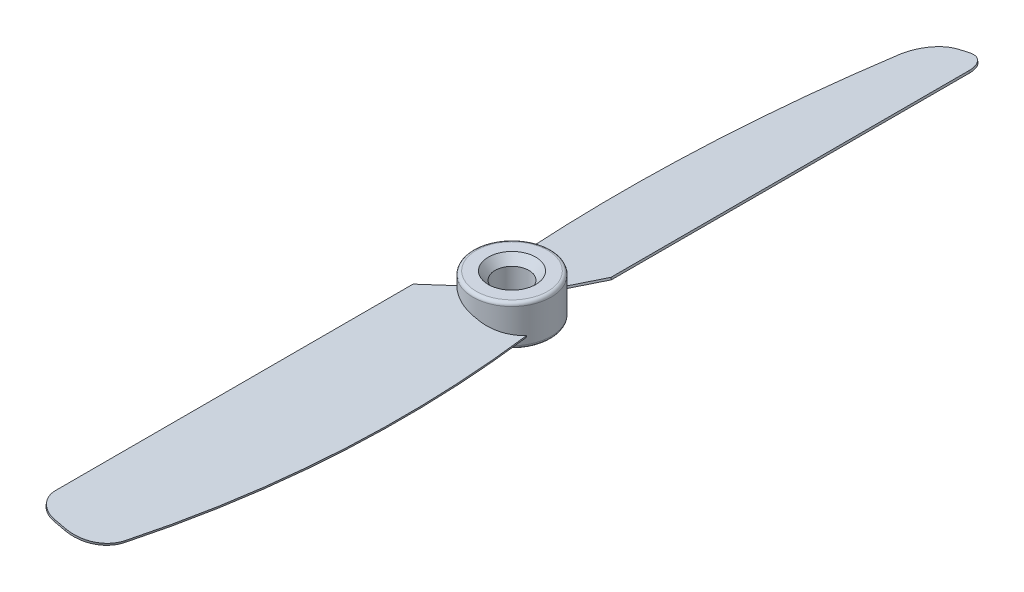
ISO-10303-21;
HEADER;
FILE_DESCRIPTION(('STEP AP214'),'2;1');
FILE_NAME('part.step','',(''),(''),'','','');
FILE_SCHEMA(('AUTOMOTIVE_DESIGN { 1 0 10303 214 1 1 1 1 }'));
ENDSEC;
DATA;
#1=APPLICATION_CONTEXT('core data for automotive mechanical design processes');
#2=APPLICATION_PROTOCOL_DEFINITION('international standard','automotive_design',2000,#1);
#3=PRODUCT_CONTEXT('',#1,'mechanical');
#4=PRODUCT('Part','Part','',(#3));
#5=PRODUCT_RELATED_PRODUCT_CATEGORY('part','',(#4));
#6=PRODUCT_DEFINITION_FORMATION('','',#4);
#7=PRODUCT_DEFINITION_CONTEXT('part definition',#1,'design');
#8=PRODUCT_DEFINITION('design','',#6,#7);
#9=PRODUCT_DEFINITION_SHAPE('','',#8);
#10=(LENGTH_UNIT() NAMED_UNIT(*) SI_UNIT(.MILLI.,.METRE.));
#11=(NAMED_UNIT(*) PLANE_ANGLE_UNIT() SI_UNIT($,.RADIAN.));
#12=(NAMED_UNIT(*) SI_UNIT($,.STERADIAN.) SOLID_ANGLE_UNIT());
#13=UNCERTAINTY_MEASURE_WITH_UNIT(LENGTH_MEASURE(1.E-05),#10,'distance_accuracy_value','');
#14=(GEOMETRIC_REPRESENTATION_CONTEXT(3) GLOBAL_UNCERTAINTY_ASSIGNED_CONTEXT((#13)) GLOBAL_UNIT_ASSIGNED_CONTEXT((#10,
#11,#12)) REPRESENTATION_CONTEXT('',''));
#15=CARTESIAN_POINT('',(0.,0.,0.));
#16=DIRECTION('',(0.,0.,1.));
#17=DIRECTION('',(1.,0.,0.));
#18=AXIS2_PLACEMENT_3D('',#15,#16,#17);
#19=CARTESIAN_POINT('',(0.,3.,0.));
#20=DIRECTION('',(0.,-1.,0.));
#21=DIRECTION('',(0.,0.,-1.));
#22=AXIS2_PLACEMENT_3D('',#19,#20,#21);
#23=CYLINDRICAL_SURFACE('',#22,5.75);
#24=CARTESIAN_POINT('',(0.,-2.5,0.));
#25=DIRECTION('',(0.,1.,0.));
#26=DIRECTION('',(0.,0.,1.));
#27=AXIS2_PLACEMENT_3D('',#24,#25,#26);
#28=CIRCLE('',#27,5.75);
#29=CARTESIAN_POINT('',(0.,-2.5,5.75));
#30=VERTEX_POINT('',#29);
#31=EDGE_CURVE('E411',#30,#30,#28,.T.);
#32=ORIENTED_EDGE('',*,*,#31,.T.);
#33=EDGE_LOOP('',(#32));
#34=FACE_BOUND('',#33,.T.);
#35=CARTESIAN_POINT('',(0.,2.5,0.));
#36=DIRECTION('',(0.,1.,0.));
#37=DIRECTION('',(0.,0.,1.));
#38=AXIS2_PLACEMENT_3D('',#35,#36,#37);
#39=CIRCLE('',#38,5.75);
#40=CARTESIAN_POINT('',(0.,2.5,5.75));
#41=VERTEX_POINT('',#40);
#42=EDGE_CURVE('E409',#41,#41,#39,.F.);
#43=ORIENTED_EDGE('',*,*,#42,.T.);
#44=EDGE_LOOP('',(#43));
#45=FACE_BOUND('',#44,.T.);
#46=CARTESIAN_POINT('',(0.,-0.153945616169009,0.));
#47=DIRECTION('',(0.224951054343865,0.974370064785235,0.));
#48=DIRECTION('',(0.974370064785235,-0.224951054343865,0.));
#49=AXIS2_PLACEMENT_3D('',#46,#47,#48);
#50=ELLIPSE('',#49,5.901248619812,5.75);
#51=CARTESIAN_POINT('',(-4.11748225008239,0.796650062899129,4.0135819314244));
#52=VERTEX_POINT('',#51);
#53=CARTESIAN_POINT('',(0.320003598355955,-0.22782426807512,5.74108854635071));
#54=VERTEX_POINT('',#53);
#55=EDGE_CURVE('E408',#52,#54,#50,.T.);
#56=ORIENTED_EDGE('',*,*,#55,.F.);
#57=CARTESIAN_POINT('',(0.,4.77330898299904,0.));
#58=DIRECTION('',(0.769518397839671,-0.177657320547087,0.613416100084025));
#59=DIRECTION('',(-0.13892046613427,-0.984092412558917,-0.110739458338062));
#60=AXIS2_PLACEMENT_3D('',#57,#58,#59);
#61=ELLIPSE('',#60,32.3656800760766,5.75);
#62=CARTESIAN_POINT('',(-4.07933525218879,1.09573436683658,4.05234794905988));
#63=VERTEX_POINT('',#62);
#64=EDGE_CURVE('E314',#63,#52,#61,.T.);
#65=ORIENTED_EDGE('',*,*,#64,.F.);
#66=CARTESIAN_POINT('',(0.,0.153945616169007,0.));
#67=DIRECTION('',(0.224951054343865,0.974370064785235,0.));
#68=DIRECTION('',(0.974370064785235,-0.224951054343865,0.));
#69=AXIS2_PLACEMENT_3D('',#66,#67,#68);
#70=ELLIPSE('',#69,5.901248619812,5.75);
#71=CARTESIAN_POINT('',(0.354622157583411,0.0720746401146822,5.73905420129059));
#72=VERTEX_POINT('',#71);
#73=EDGE_CURVE('E315',#63,#72,#70,.T.);
#74=ORIENTED_EDGE('',*,*,#73,.T.);
#75=CARTESIAN_POINT('',(0.32000359835526,-0.227824268074959,5.74108854635068));
#76=CARTESIAN_POINT('',(0.325773371717221,-0.177840999841669,5.74076694689686));
#77=CARTESIAN_POINT('',(0.331543138333848,-0.12785779004254,5.74043661841495));
#78=CARTESIAN_POINT('',(0.343082658076433,-0.0278914873126082,5.73975850339492));
#79=CARTESIAN_POINT('',(0.348852411202391,0.0220916056181957,5.7394107168568));
#80=CARTESIAN_POINT('',(0.354622157583015,0.0720746401148375,5.73905420129059));
#81=B_SPLINE_CURVE_WITH_KNOTS('',3,(#75,#76,#77,#78,#79,#80),.UNSPECIFIED.,.F.,.F.,(4,2,4),(0.,
0.150948617979297,0.301897235958594),.UNSPECIFIED.);
#82=EDGE_CURVE('E306',#54,#72,#81,.T.);
#83=ORIENTED_EDGE('',*,*,#82,.F.);
#84=EDGE_LOOP('',(#56,#65,#74,#83));
#85=FACE_BOUND('',#84,.T.);
#86=CARTESIAN_POINT('',(-0.32000359835526,-0.227824268074959,-5.74108854635068));
#87=CARTESIAN_POINT('',(-0.325773371717221,-0.177840999841669,-5.74076694689686));
#88=CARTESIAN_POINT('',(-0.331543138333848,-0.12785779004254,-5.74043661841495));
#89=CARTESIAN_POINT('',(-0.343082658076433,-0.0278914873126082,-5.73975850339492));
#90=CARTESIAN_POINT('',(-0.348852411202391,0.0220916056181957,-5.7394107168568));
#91=CARTESIAN_POINT('',(-0.354622157583015,0.0720746401148375,-5.73905420129059));
#92=B_SPLINE_CURVE_WITH_KNOTS('',3,(#86,#87,#88,#89,#90,#91),.UNSPECIFIED.,.F.,.F.,(4,2,4),(0.,
0.150948617979297,0.301897235958594),.UNSPECIFIED.);
#93=CARTESIAN_POINT('',(-0.320003598355955,-0.22782426807512,-5.74108854635071));
#94=VERTEX_POINT('',#93);
#95=CARTESIAN_POINT('',(-0.35462215758341,0.0720746401146809,-5.73905420129057));
#96=VERTEX_POINT('',#95);
#97=EDGE_CURVE('E61',#94,#96,#92,.T.);
#98=ORIENTED_EDGE('',*,*,#97,.F.);
#99=CARTESIAN_POINT('',(0.,-0.153945616169009,0.));
#100=DIRECTION('',(-0.224951054343865,0.974370064785235,0.));
#101=DIRECTION('',(-0.974370064785235,-0.224951054343865,0.));
#102=AXIS2_PLACEMENT_3D('',#99,#100,#101);
#103=ELLIPSE('',#102,5.901248619812,5.75);
#104=CARTESIAN_POINT('',(4.11748225008239,0.796650062899129,-4.0135819314244));
#105=VERTEX_POINT('',#104);
#106=EDGE_CURVE('E179',#105,#94,#103,.T.);
#107=ORIENTED_EDGE('',*,*,#106,.F.);
#108=CARTESIAN_POINT('',(0.,4.77330898299904,0.));
#109=DIRECTION('',(-0.769518397839671,-0.177657320547087,-0.613416100084025));
#110=DIRECTION('',(0.13892046613427,-0.984092412558917,0.110739458338062));
#111=AXIS2_PLACEMENT_3D('',#108,#109,#110);
#112=ELLIPSE('',#111,32.3656800760766,5.75);
#113=CARTESIAN_POINT('',(4.07933525218879,1.09573436683658,-4.05234794905988));
#114=VERTEX_POINT('',#113);
#115=EDGE_CURVE('E172',#114,#105,#112,.T.);
#116=ORIENTED_EDGE('',*,*,#115,.F.);
#117=CARTESIAN_POINT('',(0.,0.153945616169007,0.));
#118=DIRECTION('',(-0.224951054343865,0.974370064785235,0.));
#119=DIRECTION('',(-0.974370064785235,-0.224951054343865,0.));
#120=AXIS2_PLACEMENT_3D('',#117,#118,#119);
#121=ELLIPSE('',#120,5.901248619812,5.75);
#122=EDGE_CURVE('E160',#114,#96,#121,.T.);
#123=ORIENTED_EDGE('',*,*,#122,.T.);
#124=EDGE_LOOP('',(#98,#107,#116,#123));
#125=FACE_BOUND('',#124,.T.);
#126=ADVANCED_FACE('F45',(#34,#45,#85,#125),#23,.T.);
#127=CARTESIAN_POINT('',(0.,3.,0.));
#128=DIRECTION('',(0.,1.,0.));
#129=DIRECTION('',(0.,0.,1.));
#130=AXIS2_PLACEMENT_3D('',#127,#128,#129);
#131=PLANE('',#130);
#132=CARTESIAN_POINT('',(0.,3.,0.));
#133=DIRECTION('',(0.,1.,0.));
#134=DIRECTION('',(0.,0.,1.));
#135=AXIS2_PLACEMENT_3D('',#132,#133,#134);
#136=CIRCLE('',#135,3.50000000000002);
#137=CARTESIAN_POINT('',(0.,3.,3.50000000000002));
#138=VERTEX_POINT('',#137);
#139=EDGE_CURVE('E54',#138,#138,#136,.F.);
#140=ORIENTED_EDGE('',*,*,#139,.T.);
#141=EDGE_LOOP('',(#140));
#142=FACE_BOUND('',#141,.T.);
#143=CARTESIAN_POINT('',(0.,3.,0.));
#144=DIRECTION('',(0.,1.,0.));
#145=DIRECTION('',(0.,0.,1.));
#146=AXIS2_PLACEMENT_3D('',#143,#144,#145);
#147=CIRCLE('',#146,5.25);
#148=CARTESIAN_POINT('',(0.,3.,5.25));
#149=VERTEX_POINT('',#148);
#150=EDGE_CURVE('E418',#149,#149,#147,.T.);
#151=ORIENTED_EDGE('',*,*,#150,.T.);
#152=EDGE_LOOP('',(#151));
#153=FACE_BOUND('',#152,.T.);
#154=ADVANCED_FACE('F289',(#142,#153),#131,.T.);
#155=CARTESIAN_POINT('',(0.,-3.,0.));
#156=DIRECTION('',(0.,1.,0.));
#157=DIRECTION('',(0.,0.,1.));
#158=AXIS2_PLACEMENT_3D('',#155,#156,#157);
#159=PLANE('',#158);
#160=CARTESIAN_POINT('',(0.,-3.,0.));
#161=DIRECTION('',(0.,1.,0.));
#162=DIRECTION('',(0.,0.,1.));
#163=AXIS2_PLACEMENT_3D('',#160,#161,#162);
#164=CIRCLE('',#163,3.69175359259423);
#165=CARTESIAN_POINT('',(0.,-3.,3.69175359259423));
#166=VERTEX_POINT('',#165);
#167=EDGE_CURVE('E11',#166,#166,#164,.T.);
#168=ORIENTED_EDGE('',*,*,#167,.T.);
#169=EDGE_LOOP('',(#168));
#170=FACE_BOUND('',#169,.T.);
#171=CARTESIAN_POINT('',(0.,-3.,0.));
#172=DIRECTION('',(0.,1.,0.));
#173=DIRECTION('',(0.,0.,1.));
#174=AXIS2_PLACEMENT_3D('',#171,#172,#173);
#175=CIRCLE('',#174,5.25);
#176=CARTESIAN_POINT('',(0.,-3.,5.25));
#177=VERTEX_POINT('',#176);
#178=EDGE_CURVE('E415',#177,#177,#175,.F.);
#179=ORIENTED_EDGE('',*,*,#178,.T.);
#180=EDGE_LOOP('',(#179));
#181=FACE_BOUND('',#180,.T.);
#182=ADVANCED_FACE('F295',(#170,#181),#159,.F.);
#183=CARTESIAN_POINT('',(0.623814062032037,-0.297964440269035,0.));
#184=DIRECTION('',(0.224951054343865,0.974370064785235,0.));
#185=DIRECTION('',(0.,0.,1.));
#186=AXIS2_PLACEMENT_3D('',#183,#184,#185);
#187=ELLIPSE('',#186,5.75,5.6026278725151);
#188=DIRECTION('',(0.224951054343865,0.974370064785235,0.));
#189=VECTOR('',#188,1.);
#190=SURFACE_OF_LINEAR_EXTRUSION('',#187,#189);
#191=CARTESIAN_POINT('',(5.2077849263869,-1.35625750189493,3.12250659115618));
#192=VERTEX_POINT('',#191);
#193=EDGE_CURVE('E328',#54,#192,#187,.T.);
#194=ORIENTED_EDGE('',*,*,#193,.F.);
#195=ORIENTED_EDGE('',*,*,#82,.T.);
#196=CARTESIAN_POINT('',(0.691299378335197,-0.00565342083346483,0.));
#197=DIRECTION('',(0.224951054343865,0.974370064785235,0.));
#198=DIRECTION('',(0.,0.,1.));
#199=AXIS2_PLACEMENT_3D('',#196,#197,#198);
#200=ELLIPSE('',#199,5.75,5.6026278725151);
#201=CARTESIAN_POINT('',(5.27527024269006,-1.06394648245936,3.12250659115618));
#202=VERTEX_POINT('',#201);
#203=EDGE_CURVE('E69',#72,#202,#200,.T.);
#204=ORIENTED_EDGE('',*,*,#203,.T.);
#205=DIRECTION('',(0.224951054343865,0.974370064785235,0.));
#206=VECTOR('',#205,1.);
#207=CARTESIAN_POINT('',(5.2077849263869,-1.35625750189493,3.12250659115618));
#208=LINE('',#207,#206);
#209=EDGE_CURVE('E332',#192,#202,#208,.T.);
#210=ORIENTED_EDGE('',*,*,#209,.F.);
#211=EDGE_LOOP('',(#194,#195,#204,#210));
#212=FACE_BOUND('',#211,.T.);
#213=ADVANCED_FACE('F318',(#212),#190,.F.);
#214=CARTESIAN_POINT('',(5.2077849263869,-1.35625750189493,3.12250659115618));
#215=CARTESIAN_POINT('',(7.19986749436746,-1.81616600093737,22.1537497572681));
#216=CARTESIAN_POINT('',(6.25862112168956,-1.59886215347372,41.0614785175441));
#217=CARTESIAN_POINT('',(2.43133876189043,-0.715264398140119,59.5396349823268));
#218=B_SPLINE_CURVE_WITH_KNOTS('',3,(#214,#215,#216,#217),.UNSPECIFIED.,.F.,.F.,(4,4),(0.,
0.933242383466996),.UNSPECIFIED.);
#219=DIRECTION('',(0.224951054343865,0.974370064785235,0.));
#220=VECTOR('',#219,1.);
#221=SURFACE_OF_LINEAR_EXTRUSION('',#218,#220);
#222=CARTESIAN_POINT('',(5.27527024269006,-1.06394648245936,3.12250659115618));
#223=CARTESIAN_POINT('',(7.26735281067062,-1.5238549815018,22.1537497572681));
#224=CARTESIAN_POINT('',(6.32610643799272,-1.30655113403815,41.0614785175441));
#225=CARTESIAN_POINT('',(2.49882407819359,-0.422953378704549,59.5396349823268));
#226=B_SPLINE_CURVE_WITH_KNOTS('',3,(#222,#223,#224,#225),.UNSPECIFIED.,.F.,.F.,(4,4),(0.,
0.933242383466996),.UNSPECIFIED.);
#227=CARTESIAN_POINT('',(2.49882407819359,-0.422953378704548,59.5396349823268));
#228=VERTEX_POINT('',#227);
#229=EDGE_CURVE('E222',#202,#228,#226,.T.);
#230=ORIENTED_EDGE('',*,*,#229,.T.);
#231=DIRECTION('',(0.224951054343865,0.974370064785235,0.));
#232=VECTOR('',#231,1.);
#233=CARTESIAN_POINT('',(2.43133876189043,-0.715264398140119,59.5396349823268));
#234=LINE('',#233,#232);
#235=CARTESIAN_POINT('',(2.43133876189043,-0.715264398140119,59.5396349823268));
#236=VERTEX_POINT('',#235);
#237=EDGE_CURVE('E367',#236,#228,#234,.T.);
#238=ORIENTED_EDGE('',*,*,#237,.F.);
#239=EDGE_CURVE('E223',#192,#236,#218,.T.);
#240=ORIENTED_EDGE('',*,*,#239,.F.);
#241=ORIENTED_EDGE('',*,*,#209,.T.);
#242=EDGE_LOOP('',(#230,#238,#240,#241));
#243=FACE_BOUND('',#242,.T.);
#244=ADVANCED_FACE('F324',(#243),#221,.F.);
#245=CARTESIAN_POINT('',(-2.33403409331465,0.384908612979939,58.5));
#246=DIRECTION('',(0.224951054343865,0.974370064785235,0.));
#247=DIRECTION('',(-0.974370064785235,0.224951054343865,0.));
#248=AXIS2_PLACEMENT_3D('',#245,#246,#247);
#249=CYLINDRICAL_SURFACE('',#248,5.);
#250=CARTESIAN_POINT('',(-2.26654877701149,0.677219632415509,58.5));
#251=DIRECTION('',(-0.224951054343865,-0.974370064785235,0.));
#252=DIRECTION('',(0.974370064785235,-0.224951054343865,0.));
#253=AXIS2_PLACEMENT_3D('',#250,#251,#252);
#254=CIRCLE('',#253,5.);
#255=CARTESIAN_POINT('',(-2.26654877701149,0.677219632415509,63.5));
#256=VERTEX_POINT('',#255);
#257=EDGE_CURVE('E339',#228,#256,#254,.T.);
#258=ORIENTED_EDGE('',*,*,#257,.T.);
#259=DIRECTION('',(0.224951054343865,0.974370064785235,0.));
#260=VECTOR('',#259,1.);
#261=CARTESIAN_POINT('',(-2.33403409331465,0.384908612979939,63.5));
#262=LINE('',#261,#260);
#263=CARTESIAN_POINT('',(-2.33403409331465,0.384908612979939,63.5));
#264=VERTEX_POINT('',#263);
#265=EDGE_CURVE('E365',#264,#256,#262,.T.);
#266=ORIENTED_EDGE('',*,*,#265,.F.);
#267=CARTESIAN_POINT('',(-2.33403409331465,0.384908612979939,58.5));
#268=DIRECTION('',(-0.224951054343865,-0.974370064785235,0.));
#269=DIRECTION('',(0.974370064785235,-0.224951054343865,0.));
#270=AXIS2_PLACEMENT_3D('',#267,#268,#269);
#271=CIRCLE('',#270,5.);
#272=EDGE_CURVE('E400',#236,#264,#271,.T.);
#273=ORIENTED_EDGE('',*,*,#272,.F.);
#274=ORIENTED_EDGE('',*,*,#237,.T.);
#275=EDGE_LOOP('',(#258,#266,#273,#274));
#276=FACE_BOUND('',#275,.T.);
#277=ADVANCED_FACE('F399',(#276),#249,.T.);
#278=CARTESIAN_POINT('',(-4.00316351073308,0.770257502333798,63.5));
#279=DIRECTION('',(0.,0.,-1.));
#280=DIRECTION('',(-1.,0.,0.));
#281=AXIS2_PLACEMENT_3D('',#278,#279,#280);
#282=PLANE('',#281);
#283=DIRECTION('',(-0.974370064785235,0.224951054343865,0.));
#284=VECTOR('',#283,1.);
#285=CARTESIAN_POINT('',(-3.93567819442992,1.06256852176937,63.5));
#286=LINE('',#285,#284);
#287=CARTESIAN_POINT('',(-3.93567819442992,1.06256852176937,63.5));
#288=VERTEX_POINT('',#287);
#289=EDGE_CURVE('E344',#256,#288,#286,.T.);
#290=ORIENTED_EDGE('',*,*,#289,.T.);
#291=DIRECTION('',(0.224951054343865,0.974370064785235,0.));
#292=VECTOR('',#291,1.);
#293=CARTESIAN_POINT('',(-4.00316351073308,0.770257502333798,63.5));
#294=LINE('',#293,#292);
#295=CARTESIAN_POINT('',(-4.00316351073308,0.770257502333798,63.5));
#296=VERTEX_POINT('',#295);
#297=EDGE_CURVE('E362',#296,#288,#294,.T.);
#298=ORIENTED_EDGE('',*,*,#297,.F.);
#299=DIRECTION('',(-0.974370064785235,0.224951054343865,0.));
#300=VECTOR('',#299,1.);
#301=CARTESIAN_POINT('',(-4.00316351073308,0.770257502333798,63.5));
#302=LINE('',#301,#300);
#303=EDGE_CURVE('E397',#264,#296,#302,.T.);
#304=ORIENTED_EDGE('',*,*,#303,.F.);
#305=ORIENTED_EDGE('',*,*,#265,.T.);
#306=EDGE_LOOP('',(#290,#298,#304,#305));
#307=FACE_BOUND('',#306,.T.);
#308=ADVANCED_FACE('F396',(#307),#282,.F.);
#309=CARTESIAN_POINT('',(-4.0031635107331,0.770257502333802,60.5));
#310=DIRECTION('',(0.224951054343865,0.974370064785235,0.));
#311=DIRECTION('',(-0.974370064785235,0.224951054343865,0.));
#312=AXIS2_PLACEMENT_3D('',#309,#310,#311);
#313=CYLINDRICAL_SURFACE('',#312,3.);
#314=CARTESIAN_POINT('',(-3.93567819442994,1.06256852176937,60.5));
#315=DIRECTION('',(-0.224951054343865,-0.974370064785235,0.));
#316=DIRECTION('',(-0.974370064785235,0.224951054343865,0.));
#317=AXIS2_PLACEMENT_3D('',#314,#315,#316);
#318=CIRCLE('',#317,3.);
#319=CARTESIAN_POINT('',(-6.85878838878564,1.73742168480097,60.5));
#320=VERTEX_POINT('',#319);
#321=EDGE_CURVE('E346',#288,#320,#318,.T.);
#322=ORIENTED_EDGE('',*,*,#321,.T.);
#323=DIRECTION('',(0.224951054343865,0.974370064785235,0.));
#324=VECTOR('',#323,1.);
#325=CARTESIAN_POINT('',(-6.9262737050888,1.4451106653654,60.5));
#326=LINE('',#325,#324);
#327=CARTESIAN_POINT('',(-6.9262737050888,1.4451106653654,60.5));
#328=VERTEX_POINT('',#327);
#329=EDGE_CURVE('E359',#328,#320,#326,.T.);
#330=ORIENTED_EDGE('',*,*,#329,.F.);
#331=CARTESIAN_POINT('',(-4.0031635107331,0.770257502333802,60.5));
#332=DIRECTION('',(-0.224951054343865,-0.974370064785235,0.));
#333=DIRECTION('',(-0.974370064785235,0.224951054343865,0.));
#334=AXIS2_PLACEMENT_3D('',#331,#332,#333);
#335=CIRCLE('',#334,3.);
#336=EDGE_CURVE('E393',#296,#328,#335,.T.);
#337=ORIENTED_EDGE('',*,*,#336,.F.);
#338=ORIENTED_EDGE('',*,*,#297,.T.);
#339=EDGE_LOOP('',(#322,#330,#337,#338));
#340=FACE_BOUND('',#339,.T.);
#341=ADVANCED_FACE('F390',(#340),#313,.T.);
#342=CARTESIAN_POINT('',(-6.9262737050888,1.4451106653654,7.72496230296169));
#343=DIRECTION('',(0.974370064785235,-0.224951054343865,0.));
#344=DIRECTION('',(0.224951054343865,0.974370064785235,0.));
#345=AXIS2_PLACEMENT_3D('',#342,#343,#344);
#346=PLANE('',#345);
#347=DIRECTION('',(0.,0.,-1.));
#348=VECTOR('',#347,1.);
#349=CARTESIAN_POINT('',(-6.85878838878564,1.73742168480097,7.72496230296169));
#350=LINE('',#349,#348);
#351=CARTESIAN_POINT('',(-6.85878838878564,1.73742168480097,7.72496230296169));
#352=VERTEX_POINT('',#351);
#353=EDGE_CURVE('E348',#320,#352,#350,.T.);
#354=ORIENTED_EDGE('',*,*,#353,.T.);
#355=DIRECTION('',(0.224951054343865,0.974370064785235,0.));
#356=VECTOR('',#355,1.);
#357=CARTESIAN_POINT('',(-6.9262737050888,1.4451106653654,7.72496230296169));
#358=LINE('',#357,#356);
#359=CARTESIAN_POINT('',(-6.9262737050888,1.4451106653654,7.72496230296169));
#360=VERTEX_POINT('',#359);
#361=EDGE_CURVE('E356',#360,#352,#358,.T.);
#362=ORIENTED_EDGE('',*,*,#361,.F.);
#363=DIRECTION('',(0.,0.,-1.));
#364=VECTOR('',#363,1.);
#365=CARTESIAN_POINT('',(-6.9262737050888,1.4451106653654,7.72496230296169));
#366=LINE('',#365,#364);
#367=EDGE_CURVE('E385',#328,#360,#366,.T.);
#368=ORIENTED_EDGE('',*,*,#367,.F.);
#369=ORIENTED_EDGE('',*,*,#329,.T.);
#370=EDGE_LOOP('',(#354,#362,#368,#369));
#371=FACE_BOUND('',#370,.T.);
#372=ADVANCED_FACE('F384',(#371),#346,.F.);
#373=CARTESIAN_POINT('',(-3.71787981746395,0.704394572111134,3.4855695643278));
#374=DIRECTION('',(0.769518397839671,-0.177657320547087,0.613416100084025));
#375=DIRECTION('',(0.623331805281346,0.,-0.781957454421081));
#376=AXIS2_PLACEMENT_3D('',#373,#374,#375);
#377=PLANE('',#376);
#378=DIRECTION('',(0.597694285179178,-0.137988598465404,-0.789759892725444));
#379=VECTOR('',#378,1.);
#380=CARTESIAN_POINT('',(-3.65039450116079,0.996705591546704,3.4855695643278));
#381=LINE('',#380,#379);
#382=EDGE_CURVE('E350',#352,#63,#381,.T.);
#383=ORIENTED_EDGE('',*,*,#382,.T.);
#384=ORIENTED_EDGE('',*,*,#64,.T.);
#385=DIRECTION('',(0.597694285179178,-0.137988598465404,-0.789759892725444));
#386=VECTOR('',#385,1.);
#387=CARTESIAN_POINT('',(-3.71787981746395,0.704394572111134,3.4855695643278));
#388=LINE('',#387,#386);
#389=EDGE_CURVE('E333',#360,#52,#388,.T.);
#390=ORIENTED_EDGE('',*,*,#389,.F.);
#391=ORIENTED_EDGE('',*,*,#361,.T.);
#392=EDGE_LOOP('',(#383,#384,#390,#391));
#393=FACE_BOUND('',#392,.T.);
#394=ADVANCED_FACE('F326',(#393),#377,.F.);
#395=CARTESIAN_POINT('',(6.00182369205605,-1.53957579540854,31.53847829974));
#396=DIRECTION('',(0.224951054343865,0.974370064785235,0.));
#397=DIRECTION('',(-0.974370064785235,0.224951054343865,0.));
#398=AXIS2_PLACEMENT_3D('',#395,#396,#397);
#399=PLANE('',#398);
#400=ORIENTED_EDGE('',*,*,#389,.T.);
#401=ORIENTED_EDGE('',*,*,#55,.T.);
#402=ORIENTED_EDGE('',*,*,#193,.T.);
#403=ORIENTED_EDGE('',*,*,#239,.T.);
#404=ORIENTED_EDGE('',*,*,#272,.T.);
#405=ORIENTED_EDGE('',*,*,#303,.T.);
#406=ORIENTED_EDGE('',*,*,#336,.T.);
#407=ORIENTED_EDGE('',*,*,#367,.T.);
#408=EDGE_LOOP('',(#400,#401,#402,#403,#404,#405,#406,#407));
#409=FACE_BOUND('',#408,.T.);
#410=ADVANCED_FACE('F407',(#409),#399,.F.);
#411=CARTESIAN_POINT('',(6.06930900835921,-1.24726477597297,31.53847829974));
#412=DIRECTION('',(0.224951054343865,0.974370064785235,0.));
#413=DIRECTION('',(-0.974370064785235,0.224951054343865,0.));
#414=AXIS2_PLACEMENT_3D('',#411,#412,#413);
#415=PLANE('',#414);
#416=ORIENTED_EDGE('',*,*,#73,.F.);
#417=ORIENTED_EDGE('',*,*,#382,.F.);
#418=ORIENTED_EDGE('',*,*,#353,.F.);
#419=ORIENTED_EDGE('',*,*,#321,.F.);
#420=ORIENTED_EDGE('',*,*,#289,.F.);
#421=ORIENTED_EDGE('',*,*,#257,.F.);
#422=ORIENTED_EDGE('',*,*,#229,.F.);
#423=ORIENTED_EDGE('',*,*,#203,.F.);
#424=EDGE_LOOP('',(#416,#417,#418,#419,#420,#421,#422,#423));
#425=FACE_BOUND('',#424,.T.);
#426=ADVANCED_FACE('F236',(#425),#415,.T.);
#427=CARTESIAN_POINT('',(-0.623814062032037,-0.297964440269035,0.));
#428=DIRECTION('',(-0.224951054343865,0.974370064785235,0.));
#429=DIRECTION('',(0.,0.,-1.));
#430=AXIS2_PLACEMENT_3D('',#427,#428,#429);
#431=ELLIPSE('',#430,5.75,5.6026278725151);
#432=DIRECTION('',(-0.224951054343865,0.974370064785235,0.));
#433=VECTOR('',#432,1.);
#434=SURFACE_OF_LINEAR_EXTRUSION('',#431,#433);
#435=CARTESIAN_POINT('',(-5.2077849263869,-1.35625750189493,-3.12250659115618));
#436=VERTEX_POINT('',#435);
#437=EDGE_CURVE('E189',#94,#436,#431,.T.);
#438=ORIENTED_EDGE('',*,*,#437,.F.);
#439=ORIENTED_EDGE('',*,*,#97,.T.);
#440=CARTESIAN_POINT('',(-0.691299378335197,-0.00565342083346483,0.));
#441=DIRECTION('',(-0.224951054343865,0.974370064785235,0.));
#442=DIRECTION('',(0.,0.,-1.));
#443=AXIS2_PLACEMENT_3D('',#440,#441,#442);
#444=ELLIPSE('',#443,5.75,5.6026278725151);
#445=CARTESIAN_POINT('',(-5.27527024269006,-1.06394648245936,-3.12250659115618));
#446=VERTEX_POINT('',#445);
#447=EDGE_CURVE('E165',#96,#446,#444,.T.);
#448=ORIENTED_EDGE('',*,*,#447,.T.);
#449=DIRECTION('',(-0.224951054343865,0.974370064785235,0.));
#450=VECTOR('',#449,1.);
#451=CARTESIAN_POINT('',(-5.2077849263869,-1.35625750189493,-3.12250659115618));
#452=LINE('',#451,#450);
#453=EDGE_CURVE('E212',#436,#446,#452,.T.);
#454=ORIENTED_EDGE('',*,*,#453,.F.);
#455=EDGE_LOOP('',(#438,#439,#448,#454));
#456=FACE_BOUND('',#455,.T.);
#457=ADVANCED_FACE('F230',(#456),#434,.F.);
#458=CARTESIAN_POINT('',(-5.2077849263869,-1.35625750189493,-3.12250659115618));
#459=CARTESIAN_POINT('',(-7.19986749436746,-1.81616600093737,-22.1537497572681));
#460=CARTESIAN_POINT('',(-6.25862112168956,-1.59886215347372,-41.0614785175441));
#461=CARTESIAN_POINT('',(-2.43133876189043,-0.715264398140119,-59.5396349823268));
#462=B_SPLINE_CURVE_WITH_KNOTS('',3,(#458,#459,#460,#461),.UNSPECIFIED.,.F.,.F.,(4,4),(0.,
0.933242383466996),.UNSPECIFIED.);
#463=DIRECTION('',(-0.224951054343865,0.974370064785235,0.));
#464=VECTOR('',#463,1.);
#465=SURFACE_OF_LINEAR_EXTRUSION('',#462,#464);
#466=CARTESIAN_POINT('',(-5.27527024269006,-1.06394648245936,-3.12250659115618));
#467=CARTESIAN_POINT('',(-7.26735281067062,-1.5238549815018,-22.1537497572681));
#468=CARTESIAN_POINT('',(-6.32610643799272,-1.30655113403815,-41.0614785175441));
#469=CARTESIAN_POINT('',(-2.49882407819359,-0.422953378704549,-59.5396349823268));
#470=B_SPLINE_CURVE_WITH_KNOTS('',3,(#466,#467,#468,#469),.UNSPECIFIED.,.F.,.F.,(4,4),(0.,
0.933242383466996),.UNSPECIFIED.);
#471=CARTESIAN_POINT('',(-2.49882407819359,-0.422953378704548,-59.5396349823268));
#472=VERTEX_POINT('',#471);
#473=EDGE_CURVE('E183',#446,#472,#470,.T.);
#474=ORIENTED_EDGE('',*,*,#473,.T.);
#475=DIRECTION('',(-0.224951054343865,0.974370064785235,0.));
#476=VECTOR('',#475,1.);
#477=CARTESIAN_POINT('',(-2.43133876189043,-0.715264398140119,-59.5396349823268));
#478=LINE('',#477,#476);
#479=CARTESIAN_POINT('',(-2.43133876189043,-0.715264398140119,-59.5396349823268));
#480=VERTEX_POINT('',#479);
#481=EDGE_CURVE('E209',#480,#472,#478,.T.);
#482=ORIENTED_EDGE('',*,*,#481,.F.);
#483=EDGE_CURVE('E193',#436,#480,#462,.T.);
#484=ORIENTED_EDGE('',*,*,#483,.F.);
#485=ORIENTED_EDGE('',*,*,#453,.T.);
#486=EDGE_LOOP('',(#474,#482,#484,#485));
#487=FACE_BOUND('',#486,.T.);
#488=ADVANCED_FACE('F235',(#487),#465,.F.);
#489=CARTESIAN_POINT('',(2.33403409331465,0.384908612979939,-58.5));
#490=DIRECTION('',(-0.224951054343865,0.974370064785235,0.));
#491=DIRECTION('',(0.974370064785235,0.224951054343865,0.));
#492=AXIS2_PLACEMENT_3D('',#489,#490,#491);
#493=CYLINDRICAL_SURFACE('',#492,5.);
#494=CARTESIAN_POINT('',(2.26654877701149,0.677219632415509,-58.5));
#495=DIRECTION('',(0.224951054343865,-0.974370064785235,0.));
#496=DIRECTION('',(-0.974370064785235,-0.224951054343865,0.));
#497=AXIS2_PLACEMENT_3D('',#494,#495,#496);
#498=CIRCLE('',#497,5.);
#499=CARTESIAN_POINT('',(2.26654877701149,0.677219632415509,-63.5));
#500=VERTEX_POINT('',#499);
#501=EDGE_CURVE('E251',#472,#500,#498,.T.);
#502=ORIENTED_EDGE('',*,*,#501,.T.);
#503=DIRECTION('',(-0.224951054343865,0.974370064785235,0.));
#504=VECTOR('',#503,1.);
#505=CARTESIAN_POINT('',(2.33403409331465,0.384908612979939,-63.5));
#506=LINE('',#505,#504);
#507=CARTESIAN_POINT('',(2.33403409331465,0.384908612979939,-63.5));
#508=VERTEX_POINT('',#507);
#509=EDGE_CURVE('E206',#508,#500,#506,.T.);
#510=ORIENTED_EDGE('',*,*,#509,.F.);
#511=CARTESIAN_POINT('',(2.33403409331465,0.384908612979939,-58.5));
#512=DIRECTION('',(0.224951054343865,-0.974370064785235,0.));
#513=DIRECTION('',(-0.974370064785235,-0.224951054343865,0.));
#514=AXIS2_PLACEMENT_3D('',#511,#512,#513);
#515=CIRCLE('',#514,5.);
#516=EDGE_CURVE('E190',#480,#508,#515,.T.);
#517=ORIENTED_EDGE('',*,*,#516,.F.);
#518=ORIENTED_EDGE('',*,*,#481,.T.);
#519=EDGE_LOOP('',(#502,#510,#517,#518));
#520=FACE_BOUND('',#519,.T.);
#521=ADVANCED_FACE('F265',(#520),#493,.T.);
#522=CARTESIAN_POINT('',(4.00316351073308,0.770257502333798,-63.5));
#523=DIRECTION('',(0.,0.,1.));
#524=DIRECTION('',(1.,0.,0.));
#525=AXIS2_PLACEMENT_3D('',#522,#523,#524);
#526=PLANE('',#525);
#527=DIRECTION('',(0.974370064785235,0.224951054343865,0.));
#528=VECTOR('',#527,1.);
#529=CARTESIAN_POINT('',(3.93567819442992,1.06256852176937,-63.5));
#530=LINE('',#529,#528);
#531=CARTESIAN_POINT('',(3.93567819442992,1.06256852176937,-63.5));
#532=VERTEX_POINT('',#531);
#533=EDGE_CURVE('E248',#500,#532,#530,.T.);
#534=ORIENTED_EDGE('',*,*,#533,.T.);
#535=DIRECTION('',(-0.224951054343865,0.974370064785235,0.));
#536=VECTOR('',#535,1.);
#537=CARTESIAN_POINT('',(4.00316351073308,0.770257502333798,-63.5));
#538=LINE('',#537,#536);
#539=CARTESIAN_POINT('',(4.00316351073308,0.770257502333798,-63.5));
#540=VERTEX_POINT('',#539);
#541=EDGE_CURVE('E203',#540,#532,#538,.T.);
#542=ORIENTED_EDGE('',*,*,#541,.F.);
#543=DIRECTION('',(0.974370064785235,0.224951054343865,0.));
#544=VECTOR('',#543,1.);
#545=CARTESIAN_POINT('',(4.00316351073308,0.770257502333798,-63.5));
#546=LINE('',#545,#544);
#547=EDGE_CURVE('E192',#508,#540,#546,.T.);
#548=ORIENTED_EDGE('',*,*,#547,.F.);
#549=ORIENTED_EDGE('',*,*,#509,.T.);
#550=EDGE_LOOP('',(#534,#542,#548,#549));
#551=FACE_BOUND('',#550,.T.);
#552=ADVANCED_FACE('F273',(#551),#526,.F.);
#553=CARTESIAN_POINT('',(4.0031635107331,0.770257502333802,-60.5));
#554=DIRECTION('',(-0.224951054343865,0.974370064785235,0.));
#555=DIRECTION('',(0.974370064785235,0.224951054343865,0.));
#556=AXIS2_PLACEMENT_3D('',#553,#554,#555);
#557=CYLINDRICAL_SURFACE('',#556,3.);
#558=CARTESIAN_POINT('',(3.93567819442994,1.06256852176937,-60.5));
#559=DIRECTION('',(0.224951054343865,-0.974370064785235,0.));
#560=DIRECTION('',(0.974370064785235,0.224951054343865,0.));
#561=AXIS2_PLACEMENT_3D('',#558,#559,#560);
#562=CIRCLE('',#561,3.);
#563=CARTESIAN_POINT('',(6.85878838878564,1.73742168480097,-60.5));
#564=VERTEX_POINT('',#563);
#565=EDGE_CURVE('E245',#532,#564,#562,.T.);
#566=ORIENTED_EDGE('',*,*,#565,.T.);
#567=DIRECTION('',(-0.224951054343865,0.974370064785235,0.));
#568=VECTOR('',#567,1.);
#569=CARTESIAN_POINT('',(6.9262737050888,1.4451106653654,-60.5));
#570=LINE('',#569,#568);
#571=CARTESIAN_POINT('',(6.9262737050888,1.4451106653654,-60.5));
#572=VERTEX_POINT('',#571);
#573=EDGE_CURVE('E200',#572,#564,#570,.T.);
#574=ORIENTED_EDGE('',*,*,#573,.F.);
#575=CARTESIAN_POINT('',(4.0031635107331,0.770257502333802,-60.5));
#576=DIRECTION('',(0.224951054343865,-0.974370064785235,0.));
#577=DIRECTION('',(0.974370064785235,0.224951054343865,0.));
#578=AXIS2_PLACEMENT_3D('',#575,#576,#577);
#579=CIRCLE('',#578,3.);
#580=EDGE_CURVE('E195',#540,#572,#579,.T.);
#581=ORIENTED_EDGE('',*,*,#580,.F.);
#582=ORIENTED_EDGE('',*,*,#541,.T.);
#583=EDGE_LOOP('',(#566,#574,#581,#582));
#584=FACE_BOUND('',#583,.T.);
#585=ADVANCED_FACE('F275',(#584),#557,.T.);
#586=CARTESIAN_POINT('',(6.9262737050888,1.4451106653654,-7.72496230296169));
#587=DIRECTION('',(-0.974370064785235,-0.224951054343865,0.));
#588=DIRECTION('',(-0.224951054343865,0.974370064785235,0.));
#589=AXIS2_PLACEMENT_3D('',#586,#587,#588);
#590=PLANE('',#589);
#591=DIRECTION('',(0.,0.,1.));
#592=VECTOR('',#591,1.);
#593=CARTESIAN_POINT('',(6.85878838878564,1.73742168480097,-7.72496230296169));
#594=LINE('',#593,#592);
#595=CARTESIAN_POINT('',(6.85878838878564,1.73742168480097,-7.72496230296169));
#596=VERTEX_POINT('',#595);
#597=EDGE_CURVE('E176',#564,#596,#594,.T.);
#598=ORIENTED_EDGE('',*,*,#597,.T.);
#599=DIRECTION('',(-0.224951054343865,0.974370064785235,0.));
#600=VECTOR('',#599,1.);
#601=CARTESIAN_POINT('',(6.9262737050888,1.4451106653654,-7.72496230296169));
#602=LINE('',#601,#600);
#603=CARTESIAN_POINT('',(6.9262737050888,1.4451106653654,-7.72496230296169));
#604=VERTEX_POINT('',#603);
#605=EDGE_CURVE('E175',#604,#596,#602,.T.);
#606=ORIENTED_EDGE('',*,*,#605,.F.);
#607=DIRECTION('',(0.,0.,1.));
#608=VECTOR('',#607,1.);
#609=CARTESIAN_POINT('',(6.9262737050888,1.4451106653654,-7.72496230296169));
#610=LINE('',#609,#608);
#611=EDGE_CURVE('E197',#572,#604,#610,.T.);
#612=ORIENTED_EDGE('',*,*,#611,.F.);
#613=ORIENTED_EDGE('',*,*,#573,.T.);
#614=EDGE_LOOP('',(#598,#606,#612,#613));
#615=FACE_BOUND('',#614,.T.);
#616=ADVANCED_FACE('F279',(#615),#590,.F.);
#617=CARTESIAN_POINT('',(-6.00182369205605,-1.53957579540854,-31.53847829974));
#618=DIRECTION('',(-0.224951054343865,0.974370064785235,0.));
#619=DIRECTION('',(0.974370064785235,0.224951054343865,0.));
#620=AXIS2_PLACEMENT_3D('',#617,#618,#619);
#621=PLANE('',#620);
#622=DIRECTION('',(-0.597694285179178,-0.137988598465404,0.789759892725444));
#623=VECTOR('',#622,1.);
#624=CARTESIAN_POINT('',(3.71787981746395,0.704394572111134,-3.4855695643278));
#625=LINE('',#624,#623);
#626=EDGE_CURVE('E180',#604,#105,#625,.T.);
#627=ORIENTED_EDGE('',*,*,#626,.T.);
#628=ORIENTED_EDGE('',*,*,#106,.T.);
#629=ORIENTED_EDGE('',*,*,#437,.T.);
#630=ORIENTED_EDGE('',*,*,#483,.T.);
#631=ORIENTED_EDGE('',*,*,#516,.T.);
#632=ORIENTED_EDGE('',*,*,#547,.T.);
#633=ORIENTED_EDGE('',*,*,#580,.T.);
#634=ORIENTED_EDGE('',*,*,#611,.T.);
#635=EDGE_LOOP('',(#627,#628,#629,#630,#631,#632,#633,#634));
#636=FACE_BOUND('',#635,.T.);
#637=ADVANCED_FACE('F269',(#636),#621,.F.);
#638=CARTESIAN_POINT('',(3.71787981746395,0.704394572111134,-3.4855695643278));
#639=DIRECTION('',(-0.769518397839671,-0.177657320547087,-0.613416100084025));
#640=DIRECTION('',(-0.623331805281346,0.,0.781957454421081));
#641=AXIS2_PLACEMENT_3D('',#638,#639,#640);
#642=PLANE('',#641);
#643=DIRECTION('',(-0.597694285179178,-0.137988598465404,0.789759892725444));
#644=VECTOR('',#643,1.);
#645=CARTESIAN_POINT('',(3.65039450116079,0.996705591546704,-3.4855695643278));
#646=LINE('',#645,#644);
#647=EDGE_CURVE('E163',#596,#114,#646,.T.);
#648=ORIENTED_EDGE('',*,*,#647,.T.);
#649=ORIENTED_EDGE('',*,*,#115,.T.);
#650=ORIENTED_EDGE('',*,*,#626,.F.);
#651=ORIENTED_EDGE('',*,*,#605,.T.);
#652=EDGE_LOOP('',(#648,#649,#650,#651));
#653=FACE_BOUND('',#652,.T.);
#654=ADVANCED_FACE('F171',(#653),#642,.F.);
#655=CARTESIAN_POINT('',(-6.06930900835921,-1.24726477597297,-31.53847829974));
#656=DIRECTION('',(-0.224951054343865,0.974370064785235,0.));
#657=DIRECTION('',(0.974370064785235,0.224951054343865,0.));
#658=AXIS2_PLACEMENT_3D('',#655,#656,#657);
#659=PLANE('',#658);
#660=ORIENTED_EDGE('',*,*,#122,.F.);
#661=ORIENTED_EDGE('',*,*,#647,.F.);
#662=ORIENTED_EDGE('',*,*,#597,.F.);
#663=ORIENTED_EDGE('',*,*,#565,.F.);
#664=ORIENTED_EDGE('',*,*,#533,.F.);
#665=ORIENTED_EDGE('',*,*,#501,.F.);
#666=ORIENTED_EDGE('',*,*,#473,.F.);
#667=ORIENTED_EDGE('',*,*,#447,.F.);
#668=EDGE_LOOP('',(#660,#661,#662,#663,#664,#665,#666,#667));
#669=FACE_BOUND('',#668,.T.);
#670=ADVANCED_FACE('F162',(#669),#659,.T.);
#671=CARTESIAN_POINT('',(0.,-3.,0.));
#672=DIRECTION('',(0.,1.,0.));
#673=DIRECTION('',(0.,0.,1.));
#674=AXIS2_PLACEMENT_3D('',#671,#672,#673);
#675=CYLINDRICAL_SURFACE('',#674,2.5);
#676=CARTESIAN_POINT('',(0.,1.80824640740578,0.));
#677=DIRECTION('',(0.,1.,0.));
#678=DIRECTION('',(0.,0.,1.));
#679=AXIS2_PLACEMENT_3D('',#676,#677,#678);
#680=CIRCLE('',#679,2.5);
#681=CARTESIAN_POINT('',(0.,1.80824640740578,2.5));
#682=VERTEX_POINT('',#681);
#683=EDGE_CURVE('E424',#682,#682,#680,.T.);
#684=ORIENTED_EDGE('',*,*,#683,.T.);
#685=EDGE_LOOP('',(#684));
#686=FACE_BOUND('',#685,.T.);
#687=CARTESIAN_POINT('',(0.,-1.99999999999997,0.));
#688=DIRECTION('',(0.,1.,0.));
#689=DIRECTION('',(0.,0.,1.));
#690=AXIS2_PLACEMENT_3D('',#687,#688,#689);
#691=CIRCLE('',#690,2.5);
#692=CARTESIAN_POINT('',(0.,-1.99999999999997,2.5));
#693=VERTEX_POINT('',#692);
#694=EDGE_CURVE('E421',#693,#693,#691,.F.);
#695=ORIENTED_EDGE('',*,*,#694,.T.);
#696=EDGE_LOOP('',(#695));
#697=FACE_BOUND('',#696,.T.);
#698=ADVANCED_FACE('F436',(#686,#697),#675,.F.);
#699=CARTESIAN_POINT('',(0.,-2.5,0.));
#700=DIRECTION('',(0.,1.,0.));
#701=DIRECTION('',(0.,0.,1.));
#702=AXIS2_PLACEMENT_3D('',#699,#700,#701);
#703=TOROIDAL_SURFACE('',#702,5.25,0.5);
#704=ORIENTED_EDGE('',*,*,#178,.F.);
#705=EDGE_LOOP('',(#704));
#706=FACE_BOUND('',#705,.T.);
#707=ORIENTED_EDGE('',*,*,#31,.F.);
#708=EDGE_LOOP('',(#707));
#709=FACE_BOUND('',#708,.T.);
#710=ADVANCED_FACE('F303',(#706,#709),#703,.T.);
#711=CARTESIAN_POINT('',(0.,2.5,0.));
#712=DIRECTION('',(0.,1.,0.));
#713=DIRECTION('',(0.,0.,1.));
#714=AXIS2_PLACEMENT_3D('',#711,#712,#713);
#715=TOROIDAL_SURFACE('',#714,5.25,0.5);
#716=ORIENTED_EDGE('',*,*,#42,.F.);
#717=EDGE_LOOP('',(#716));
#718=FACE_BOUND('',#717,.T.);
#719=ORIENTED_EDGE('',*,*,#150,.F.);
#720=EDGE_LOOP('',(#719));
#721=FACE_BOUND('',#720,.T.);
#722=ADVANCED_FACE('F433',(#718,#721),#715,.T.);
#723=CARTESIAN_POINT('',(0.,1.80824640740578,0.));
#724=DIRECTION('',(0.,1.,0.));
#725=DIRECTION('',(0.,0.,1.));
#726=AXIS2_PLACEMENT_3D('',#723,#724,#725);
#727=CONICAL_SURFACE('',#726,2.5,0.698131700797737);
#728=ORIENTED_EDGE('',*,*,#139,.F.);
#729=EDGE_LOOP('',(#728));
#730=FACE_BOUND('',#729,.T.);
#731=ORIENTED_EDGE('',*,*,#683,.F.);
#732=EDGE_LOOP('',(#731));
#733=FACE_BOUND('',#732,.T.);
#734=ADVANCED_FACE('F430',(#730,#733),#727,.F.);
#735=CARTESIAN_POINT('',(0.,-3.,0.));
#736=DIRECTION('',(0.,-1.,0.));
#737=DIRECTION('',(0.,0.,-1.));
#738=AXIS2_PLACEMENT_3D('',#735,#736,#737);
#739=CONICAL_SURFACE('',#738,3.69175359259423,0.872664625997161);
#740=ORIENTED_EDGE('',*,*,#694,.F.);
#741=EDGE_LOOP('',(#740));
#742=FACE_BOUND('',#741,.T.);
#743=ORIENTED_EDGE('',*,*,#167,.F.);
#744=EDGE_LOOP('',(#743));
#745=FACE_BOUND('',#744,.T.);
#746=ADVANCED_FACE('F48',(#742,#745),#739,.F.);
#747=CLOSED_SHELL('',(#126,#154,#182,#213,#244,#277,#308,#341,#372,#394,#410,#426,#457,#488,
#521,#552,#585,#616,#637,#654,#670,#698,#710,#722,#734,#746));
#748=MANIFOLD_SOLID_BREP('B2',#747);
#749=ADVANCED_BREP_SHAPE_REPRESENTATION('',(#18,#748),#14);
#750=SHAPE_DEFINITION_REPRESENTATION(#9,#749);
ENDSEC;
END-ISO-10303-21;
